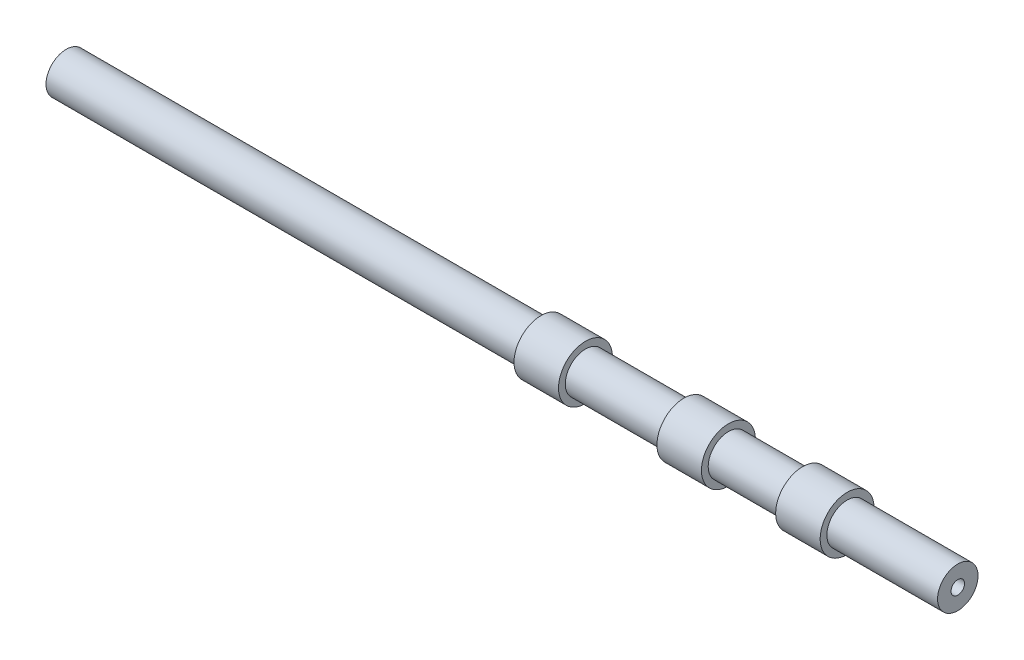
ISO-10303-21;
HEADER;
FILE_DESCRIPTION(('STEP AP214'),'2;1');
FILE_NAME('part.step','',(''),(''),'','','');
FILE_SCHEMA(('AUTOMOTIVE_DESIGN { 1 0 10303 214 1 1 1 1 }'));
ENDSEC;
DATA;
#1=APPLICATION_CONTEXT('core data for automotive mechanical design processes');
#2=APPLICATION_PROTOCOL_DEFINITION('international standard','automotive_design',2000,#1);
#3=PRODUCT_CONTEXT('',#1,'mechanical');
#4=PRODUCT('Part','Part','',(#3));
#5=PRODUCT_RELATED_PRODUCT_CATEGORY('part','',(#4));
#6=PRODUCT_DEFINITION_FORMATION('','',#4);
#7=PRODUCT_DEFINITION_CONTEXT('part definition',#1,'design');
#8=PRODUCT_DEFINITION('design','',#6,#7);
#9=PRODUCT_DEFINITION_SHAPE('','',#8);
#10=(LENGTH_UNIT() NAMED_UNIT(*) SI_UNIT(.MILLI.,.METRE.));
#11=(NAMED_UNIT(*) PLANE_ANGLE_UNIT() SI_UNIT($,.RADIAN.));
#12=(NAMED_UNIT(*) SI_UNIT($,.STERADIAN.) SOLID_ANGLE_UNIT());
#13=UNCERTAINTY_MEASURE_WITH_UNIT(LENGTH_MEASURE(1.E-05),#10,'distance_accuracy_value','');
#14=(GEOMETRIC_REPRESENTATION_CONTEXT(3) GLOBAL_UNCERTAINTY_ASSIGNED_CONTEXT((#13)) GLOBAL_UNIT_ASSIGNED_CONTEXT((#10,
#11,#12)) REPRESENTATION_CONTEXT('',''));
#15=CARTESIAN_POINT('',(0.,0.,0.));
#16=DIRECTION('',(0.,0.,1.));
#17=DIRECTION('',(1.,0.,0.));
#18=AXIS2_PLACEMENT_3D('',#15,#16,#17);
#19=CARTESIAN_POINT('',(-141.8294649099,0.,0.));
#20=DIRECTION('',(-1.,0.,0.));
#21=DIRECTION('',(0.,0.,1.));
#22=AXIS2_PLACEMENT_3D('',#19,#20,#21);
#23=CYLINDRICAL_SURFACE('',#22,15.);
#24=CARTESIAN_POINT('',(-374.696506637372,0.,0.));
#25=DIRECTION('',(-1.,0.,0.));
#26=DIRECTION('',(0.,0.,1.));
#27=AXIS2_PLACEMENT_3D('',#24,#25,#26);
#28=CIRCLE('',#27,15.);
#29=CARTESIAN_POINT('',(-374.696506637372,0.,15.));
#30=VERTEX_POINT('',#29);
#31=EDGE_CURVE('E119',#30,#30,#28,.T.);
#32=ORIENTED_EDGE('',*,*,#31,.F.);
#33=EDGE_LOOP('',(#32));
#34=FACE_BOUND('',#33,.T.);
#35=CARTESIAN_POINT('',(-22.8165066373719,0.,0.));
#36=DIRECTION('',(-1.,0.,0.));
#37=DIRECTION('',(0.,0.,1.));
#38=AXIS2_PLACEMENT_3D('',#35,#36,#37);
#39=CIRCLE('',#38,15.);
#40=CARTESIAN_POINT('',(-22.8165066373719,0.,15.));
#41=VERTEX_POINT('',#40);
#42=EDGE_CURVE('E10',#41,#41,#39,.T.);
#43=ORIENTED_EDGE('',*,*,#42,.T.);
#44=EDGE_LOOP('',(#43));
#45=FACE_BOUND('',#44,.T.);
#46=ADVANCED_FACE('F31',(#34,#45),#23,.T.);
#47=CARTESIAN_POINT('',(-22.8165066373719,20.,0.));
#48=DIRECTION('',(1.,0.,0.));
#49=DIRECTION('',(0.,0.,-1.));
#50=AXIS2_PLACEMENT_3D('',#47,#48,#49);
#51=PLANE('',#50);
#52=ORIENTED_EDGE('',*,*,#42,.F.);
#53=EDGE_LOOP('',(#52));
#54=FACE_BOUND('',#53,.T.);
#55=CARTESIAN_POINT('',(-22.8165066373719,0.,0.));
#56=DIRECTION('',(-1.,0.,0.));
#57=DIRECTION('',(0.,0.,1.));
#58=AXIS2_PLACEMENT_3D('',#55,#56,#57);
#59=CIRCLE('',#58,20.);
#60=CARTESIAN_POINT('',(-22.8165066373719,0.,20.));
#61=VERTEX_POINT('',#60);
#62=EDGE_CURVE('E37',#61,#61,#59,.T.);
#63=ORIENTED_EDGE('',*,*,#62,.T.);
#64=EDGE_LOOP('',(#63));
#65=FACE_BOUND('',#64,.T.);
#66=ADVANCED_FACE('F127',(#54,#65),#51,.F.);
#67=CARTESIAN_POINT('',(-141.8294649099,0.,0.));
#68=DIRECTION('',(-1.,0.,0.));
#69=DIRECTION('',(0.,0.,1.));
#70=AXIS2_PLACEMENT_3D('',#67,#68,#69);
#71=CYLINDRICAL_SURFACE('',#70,20.);
#72=ORIENTED_EDGE('',*,*,#62,.F.);
#73=EDGE_LOOP('',(#72));
#74=FACE_BOUND('',#73,.T.);
#75=CARTESIAN_POINT('',(10.1534933626281,0.,0.));
#76=DIRECTION('',(-1.,0.,0.));
#77=DIRECTION('',(0.,0.,1.));
#78=AXIS2_PLACEMENT_3D('',#75,#76,#77);
#79=CIRCLE('',#78,20.);
#80=CARTESIAN_POINT('',(10.1534933626281,0.,20.));
#81=VERTEX_POINT('',#80);
#82=EDGE_CURVE('E41',#81,#81,#79,.T.);
#83=ORIENTED_EDGE('',*,*,#82,.T.);
#84=EDGE_LOOP('',(#83));
#85=FACE_BOUND('',#84,.T.);
#86=ADVANCED_FACE('F131',(#74,#85),#71,.T.);
#87=CARTESIAN_POINT('',(10.1534933626281,15.,0.));
#88=DIRECTION('',(-1.,0.,0.));
#89=DIRECTION('',(0.,0.,1.));
#90=AXIS2_PLACEMENT_3D('',#87,#88,#89);
#91=PLANE('',#90);
#92=ORIENTED_EDGE('',*,*,#82,.F.);
#93=EDGE_LOOP('',(#92));
#94=FACE_BOUND('',#93,.T.);
#95=CARTESIAN_POINT('',(10.1534933626281,0.,0.));
#96=DIRECTION('',(-1.,0.,0.));
#97=DIRECTION('',(0.,0.,1.));
#98=AXIS2_PLACEMENT_3D('',#95,#96,#97);
#99=CIRCLE('',#98,15.);
#100=CARTESIAN_POINT('',(10.1534933626281,0.,15.));
#101=VERTEX_POINT('',#100);
#102=EDGE_CURVE('E45',#101,#101,#99,.T.);
#103=ORIENTED_EDGE('',*,*,#102,.T.);
#104=EDGE_LOOP('',(#103));
#105=FACE_BOUND('',#104,.T.);
#106=ADVANCED_FACE('F136',(#94,#105),#91,.F.);
#107=CARTESIAN_POINT('',(-141.8294649099,0.,0.));
#108=DIRECTION('',(-1.,0.,0.));
#109=DIRECTION('',(0.,0.,1.));
#110=AXIS2_PLACEMENT_3D('',#107,#108,#109);
#111=CYLINDRICAL_SURFACE('',#110,15.);
#112=ORIENTED_EDGE('',*,*,#102,.F.);
#113=EDGE_LOOP('',(#112));
#114=FACE_BOUND('',#113,.T.);
#115=CARTESIAN_POINT('',(83.1234933626281,0.,0.));
#116=DIRECTION('',(-1.,0.,0.));
#117=DIRECTION('',(0.,0.,1.));
#118=AXIS2_PLACEMENT_3D('',#115,#116,#117);
#119=CIRCLE('',#118,15.);
#120=CARTESIAN_POINT('',(83.1234933626281,0.,15.));
#121=VERTEX_POINT('',#120);
#122=EDGE_CURVE('E50',#121,#121,#119,.T.);
#123=ORIENTED_EDGE('',*,*,#122,.T.);
#124=EDGE_LOOP('',(#123));
#125=FACE_BOUND('',#124,.T.);
#126=ADVANCED_FACE('F142',(#114,#125),#111,.T.);
#127=CARTESIAN_POINT('',(83.1234933626281,20.,0.));
#128=DIRECTION('',(1.,0.,0.));
#129=DIRECTION('',(0.,0.,-1.));
#130=AXIS2_PLACEMENT_3D('',#127,#128,#129);
#131=PLANE('',#130);
#132=ORIENTED_EDGE('',*,*,#122,.F.);
#133=EDGE_LOOP('',(#132));
#134=FACE_BOUND('',#133,.T.);
#135=CARTESIAN_POINT('',(83.1234933626281,0.,0.));
#136=DIRECTION('',(-1.,0.,0.));
#137=DIRECTION('',(0.,0.,1.));
#138=AXIS2_PLACEMENT_3D('',#135,#136,#137);
#139=CIRCLE('',#138,20.);
#140=CARTESIAN_POINT('',(83.1234933626281,0.,20.));
#141=VERTEX_POINT('',#140);
#142=EDGE_CURVE('E53',#141,#141,#139,.T.);
#143=ORIENTED_EDGE('',*,*,#142,.T.);
#144=EDGE_LOOP('',(#143));
#145=FACE_BOUND('',#144,.T.);
#146=ADVANCED_FACE('F146',(#134,#145),#131,.F.);
#147=CARTESIAN_POINT('',(-141.8294649099,0.,0.));
#148=DIRECTION('',(-1.,0.,0.));
#149=DIRECTION('',(0.,0.,1.));
#150=AXIS2_PLACEMENT_3D('',#147,#148,#149);
#151=CYLINDRICAL_SURFACE('',#150,20.);
#152=ORIENTED_EDGE('',*,*,#142,.F.);
#153=EDGE_LOOP('',(#152));
#154=FACE_BOUND('',#153,.T.);
#155=CARTESIAN_POINT('',(116.093493362628,0.,0.));
#156=DIRECTION('',(-1.,0.,0.));
#157=DIRECTION('',(0.,0.,1.));
#158=AXIS2_PLACEMENT_3D('',#155,#156,#157);
#159=CIRCLE('',#158,20.);
#160=CARTESIAN_POINT('',(116.093493362628,0.,20.));
#161=VERTEX_POINT('',#160);
#162=EDGE_CURVE('E56',#161,#161,#159,.T.);
#163=ORIENTED_EDGE('',*,*,#162,.T.);
#164=EDGE_LOOP('',(#163));
#165=FACE_BOUND('',#164,.T.);
#166=ADVANCED_FACE('F150',(#154,#165),#151,.T.);
#167=CARTESIAN_POINT('',(116.093493362628,15.,0.));
#168=DIRECTION('',(-1.,0.,0.));
#169=DIRECTION('',(0.,0.,1.));
#170=AXIS2_PLACEMENT_3D('',#167,#168,#169);
#171=PLANE('',#170);
#172=ORIENTED_EDGE('',*,*,#162,.F.);
#173=EDGE_LOOP('',(#172));
#174=FACE_BOUND('',#173,.T.);
#175=CARTESIAN_POINT('',(116.093493362628,0.,0.));
#176=DIRECTION('',(-1.,0.,0.));
#177=DIRECTION('',(0.,0.,1.));
#178=AXIS2_PLACEMENT_3D('',#175,#176,#177);
#179=CIRCLE('',#178,15.);
#180=CARTESIAN_POINT('',(116.093493362628,0.,15.));
#181=VERTEX_POINT('',#180);
#182=EDGE_CURVE('E59',#181,#181,#179,.T.);
#183=ORIENTED_EDGE('',*,*,#182,.T.);
#184=EDGE_LOOP('',(#183));
#185=FACE_BOUND('',#184,.T.);
#186=ADVANCED_FACE('F154',(#174,#185),#171,.F.);
#187=CARTESIAN_POINT('',(-141.8294649099,0.,0.));
#188=DIRECTION('',(-1.,0.,0.));
#189=DIRECTION('',(0.,0.,1.));
#190=AXIS2_PLACEMENT_3D('',#187,#188,#189);
#191=CYLINDRICAL_SURFACE('',#190,15.);
#192=ORIENTED_EDGE('',*,*,#182,.F.);
#193=EDGE_LOOP('',(#192));
#194=FACE_BOUND('',#193,.T.);
#195=CARTESIAN_POINT('',(171.093493362628,0.,0.));
#196=DIRECTION('',(-1.,0.,0.));
#197=DIRECTION('',(0.,0.,1.));
#198=AXIS2_PLACEMENT_3D('',#195,#196,#197);
#199=CIRCLE('',#198,15.);
#200=CARTESIAN_POINT('',(171.093493362628,0.,15.));
#201=VERTEX_POINT('',#200);
#202=EDGE_CURVE('E62',#201,#201,#199,.T.);
#203=ORIENTED_EDGE('',*,*,#202,.T.);
#204=EDGE_LOOP('',(#203));
#205=FACE_BOUND('',#204,.T.);
#206=ADVANCED_FACE('F158',(#194,#205),#191,.T.);
#207=CARTESIAN_POINT('',(171.093493362628,20.,0.));
#208=DIRECTION('',(1.,0.,0.));
#209=DIRECTION('',(0.,0.,-1.));
#210=AXIS2_PLACEMENT_3D('',#207,#208,#209);
#211=PLANE('',#210);
#212=ORIENTED_EDGE('',*,*,#202,.F.);
#213=EDGE_LOOP('',(#212));
#214=FACE_BOUND('',#213,.T.);
#215=CARTESIAN_POINT('',(171.093493362628,0.,0.));
#216=DIRECTION('',(-1.,0.,0.));
#217=DIRECTION('',(0.,0.,1.));
#218=AXIS2_PLACEMENT_3D('',#215,#216,#217);
#219=CIRCLE('',#218,20.);
#220=CARTESIAN_POINT('',(171.093493362628,0.,20.));
#221=VERTEX_POINT('',#220);
#222=EDGE_CURVE('E65',#221,#221,#219,.T.);
#223=ORIENTED_EDGE('',*,*,#222,.T.);
#224=EDGE_LOOP('',(#223));
#225=FACE_BOUND('',#224,.T.);
#226=ADVANCED_FACE('F162',(#214,#225),#211,.F.);
#227=CARTESIAN_POINT('',(-141.8294649099,0.,0.));
#228=DIRECTION('',(-1.,0.,0.));
#229=DIRECTION('',(0.,0.,1.));
#230=AXIS2_PLACEMENT_3D('',#227,#228,#229);
#231=CYLINDRICAL_SURFACE('',#230,20.);
#232=ORIENTED_EDGE('',*,*,#222,.F.);
#233=EDGE_LOOP('',(#232));
#234=FACE_BOUND('',#233,.T.);
#235=CARTESIAN_POINT('',(204.063493362628,0.,0.));
#236=DIRECTION('',(-1.,0.,0.));
#237=DIRECTION('',(0.,0.,1.));
#238=AXIS2_PLACEMENT_3D('',#235,#236,#237);
#239=CIRCLE('',#238,20.);
#240=CARTESIAN_POINT('',(204.063493362628,0.,20.));
#241=VERTEX_POINT('',#240);
#242=EDGE_CURVE('E68',#241,#241,#239,.T.);
#243=ORIENTED_EDGE('',*,*,#242,.T.);
#244=EDGE_LOOP('',(#243));
#245=FACE_BOUND('',#244,.T.);
#246=ADVANCED_FACE('F166',(#234,#245),#231,.T.);
#247=CARTESIAN_POINT('',(204.063493362628,15.,0.));
#248=DIRECTION('',(-1.,0.,0.));
#249=DIRECTION('',(0.,0.,1.));
#250=AXIS2_PLACEMENT_3D('',#247,#248,#249);
#251=PLANE('',#250);
#252=ORIENTED_EDGE('',*,*,#242,.F.);
#253=EDGE_LOOP('',(#252));
#254=FACE_BOUND('',#253,.T.);
#255=CARTESIAN_POINT('',(204.063493362628,0.,0.));
#256=DIRECTION('',(-1.,0.,0.));
#257=DIRECTION('',(0.,0.,1.));
#258=AXIS2_PLACEMENT_3D('',#255,#256,#257);
#259=CIRCLE('',#258,15.);
#260=CARTESIAN_POINT('',(204.063493362628,0.,15.));
#261=VERTEX_POINT('',#260);
#262=EDGE_CURVE('E71',#261,#261,#259,.T.);
#263=ORIENTED_EDGE('',*,*,#262,.T.);
#264=EDGE_LOOP('',(#263));
#265=FACE_BOUND('',#264,.T.);
#266=ADVANCED_FACE('F170',(#254,#265),#251,.F.);
#267=CARTESIAN_POINT('',(-141.8294649099,0.,0.));
#268=DIRECTION('',(-1.,0.,0.));
#269=DIRECTION('',(0.,0.,1.));
#270=AXIS2_PLACEMENT_3D('',#267,#268,#269);
#271=CYLINDRICAL_SURFACE('',#270,15.);
#272=ORIENTED_EDGE('',*,*,#262,.F.);
#273=EDGE_LOOP('',(#272));
#274=FACE_BOUND('',#273,.T.);
#275=CARTESIAN_POINT('',(286.093493362628,0.,0.));
#276=DIRECTION('',(-1.,0.,0.));
#277=DIRECTION('',(0.,0.,1.));
#278=AXIS2_PLACEMENT_3D('',#275,#276,#277);
#279=CIRCLE('',#278,15.);
#280=CARTESIAN_POINT('',(286.093493362628,0.,15.));
#281=VERTEX_POINT('',#280);
#282=EDGE_CURVE('E74',#281,#281,#279,.T.);
#283=ORIENTED_EDGE('',*,*,#282,.T.);
#284=EDGE_LOOP('',(#283));
#285=FACE_BOUND('',#284,.T.);
#286=ADVANCED_FACE('F174',(#274,#285),#271,.T.);
#287=CARTESIAN_POINT('',(286.093493362628,15.,0.));
#288=DIRECTION('',(1.,0.,0.));
#289=DIRECTION('',(0.,0.,-1.));
#290=AXIS2_PLACEMENT_3D('',#287,#288,#289);
#291=PLANE('',#290);
#292=CARTESIAN_POINT('',(286.093493362628,0.,0.));
#293=DIRECTION('',(-1.,0.,0.));
#294=DIRECTION('',(0.,0.,1.));
#295=AXIS2_PLACEMENT_3D('',#292,#293,#294);
#296=CIRCLE('',#295,5.);
#297=CARTESIAN_POINT('',(286.093493362628,0.,5.));
#298=VERTEX_POINT('',#297);
#299=EDGE_CURVE('E77',#298,#298,#296,.T.);
#300=ORIENTED_EDGE('',*,*,#299,.T.);
#301=EDGE_LOOP('',(#300));
#302=FACE_BOUND('',#301,.T.);
#303=ORIENTED_EDGE('',*,*,#282,.F.);
#304=EDGE_LOOP('',(#303));
#305=FACE_BOUND('',#304,.T.);
#306=ADVANCED_FACE('F178',(#302,#305),#291,.T.);
#307=CARTESIAN_POINT('',(-141.8294649099,0.,0.));
#308=DIRECTION('',(-1.,0.,0.));
#309=DIRECTION('',(0.,0.,1.));
#310=AXIS2_PLACEMENT_3D('',#307,#308,#309);
#311=CYLINDRICAL_SURFACE('',#310,4.99999999999999);
#312=CARTESIAN_POINT('',(194.063493362628,0.,0.));
#313=DIRECTION('',(-1.,0.,0.));
#314=DIRECTION('',(0.,0.,1.));
#315=AXIS2_PLACEMENT_3D('',#312,#313,#314);
#316=CIRCLE('',#315,4.99999999999998);
#317=CARTESIAN_POINT('',(194.063493362628,0.,4.99999999999998));
#318=VERTEX_POINT('',#317);
#319=EDGE_CURVE('E80',#318,#318,#316,.T.);
#320=ORIENTED_EDGE('',*,*,#319,.T.);
#321=EDGE_LOOP('',(#320));
#322=FACE_BOUND('',#321,.T.);
#323=ORIENTED_EDGE('',*,*,#299,.F.);
#324=EDGE_LOOP('',(#323));
#325=FACE_BOUND('',#324,.T.);
#326=ADVANCED_FACE('F182',(#322,#325),#311,.F.);
#327=CARTESIAN_POINT('',(194.063493362628,15.,0.));
#328=DIRECTION('',(-1.,0.,0.));
#329=DIRECTION('',(0.,0.,1.));
#330=AXIS2_PLACEMENT_3D('',#327,#328,#329);
#331=PLANE('',#330);
#332=CARTESIAN_POINT('',(194.063493362628,0.,0.));
#333=DIRECTION('',(-1.,0.,0.));
#334=DIRECTION('',(0.,0.,1.));
#335=AXIS2_PLACEMENT_3D('',#332,#333,#334);
#336=CIRCLE('',#335,10.);
#337=CARTESIAN_POINT('',(194.063493362628,0.,10.));
#338=VERTEX_POINT('',#337);
#339=EDGE_CURVE('E83',#338,#338,#336,.T.);
#340=ORIENTED_EDGE('',*,*,#339,.T.);
#341=EDGE_LOOP('',(#340));
#342=FACE_BOUND('',#341,.T.);
#343=ORIENTED_EDGE('',*,*,#319,.F.);
#344=EDGE_LOOP('',(#343));
#345=FACE_BOUND('',#344,.T.);
#346=ADVANCED_FACE('F186',(#342,#345),#331,.T.);
#347=CARTESIAN_POINT('',(-141.8294649099,0.,0.));
#348=DIRECTION('',(-1.,0.,0.));
#349=DIRECTION('',(0.,0.,1.));
#350=AXIS2_PLACEMENT_3D('',#347,#348,#349);
#351=CYLINDRICAL_SURFACE('',#350,10.);
#352=CARTESIAN_POINT('',(181.093493362628,0.,0.));
#353=DIRECTION('',(-1.,0.,0.));
#354=DIRECTION('',(0.,0.,1.));
#355=AXIS2_PLACEMENT_3D('',#352,#353,#354);
#356=CIRCLE('',#355,10.);
#357=CARTESIAN_POINT('',(181.093493362628,0.,10.));
#358=VERTEX_POINT('',#357);
#359=EDGE_CURVE('E86',#358,#358,#356,.T.);
#360=ORIENTED_EDGE('',*,*,#359,.T.);
#361=EDGE_LOOP('',(#360));
#362=FACE_BOUND('',#361,.T.);
#363=ORIENTED_EDGE('',*,*,#339,.F.);
#364=EDGE_LOOP('',(#363));
#365=FACE_BOUND('',#364,.T.);
#366=ADVANCED_FACE('F190',(#362,#365),#351,.F.);
#367=CARTESIAN_POINT('',(181.093493362628,20.,0.));
#368=DIRECTION('',(1.,0.,0.));
#369=DIRECTION('',(0.,0.,-1.));
#370=AXIS2_PLACEMENT_3D('',#367,#368,#369);
#371=PLANE('',#370);
#372=CARTESIAN_POINT('',(181.093493362628,0.,0.));
#373=DIRECTION('',(-1.,0.,0.));
#374=DIRECTION('',(0.,0.,1.));
#375=AXIS2_PLACEMENT_3D('',#372,#373,#374);
#376=CIRCLE('',#375,5.);
#377=CARTESIAN_POINT('',(181.093493362628,0.,5.));
#378=VERTEX_POINT('',#377);
#379=EDGE_CURVE('E89',#378,#378,#376,.T.);
#380=ORIENTED_EDGE('',*,*,#379,.T.);
#381=EDGE_LOOP('',(#380));
#382=FACE_BOUND('',#381,.T.);
#383=ORIENTED_EDGE('',*,*,#359,.F.);
#384=EDGE_LOOP('',(#383));
#385=FACE_BOUND('',#384,.T.);
#386=ADVANCED_FACE('F194',(#382,#385),#371,.T.);
#387=CARTESIAN_POINT('',(-141.8294649099,0.,0.));
#388=DIRECTION('',(-1.,0.,0.));
#389=DIRECTION('',(0.,0.,1.));
#390=AXIS2_PLACEMENT_3D('',#387,#388,#389);
#391=CYLINDRICAL_SURFACE('',#390,5.);
#392=CARTESIAN_POINT('',(106.093493362628,0.,0.));
#393=DIRECTION('',(-1.,0.,0.));
#394=DIRECTION('',(0.,0.,1.));
#395=AXIS2_PLACEMENT_3D('',#392,#393,#394);
#396=CIRCLE('',#395,4.99999999999999);
#397=CARTESIAN_POINT('',(106.093493362628,0.,4.99999999999999));
#398=VERTEX_POINT('',#397);
#399=EDGE_CURVE('E92',#398,#398,#396,.T.);
#400=ORIENTED_EDGE('',*,*,#399,.T.);
#401=EDGE_LOOP('',(#400));
#402=FACE_BOUND('',#401,.T.);
#403=ORIENTED_EDGE('',*,*,#379,.F.);
#404=EDGE_LOOP('',(#403));
#405=FACE_BOUND('',#404,.T.);
#406=ADVANCED_FACE('F198',(#402,#405),#391,.F.);
#407=CARTESIAN_POINT('',(106.093493362628,15.,0.));
#408=DIRECTION('',(-1.,0.,0.));
#409=DIRECTION('',(0.,0.,1.));
#410=AXIS2_PLACEMENT_3D('',#407,#408,#409);
#411=PLANE('',#410);
#412=CARTESIAN_POINT('',(106.093493362628,0.,0.));
#413=DIRECTION('',(-1.,0.,0.));
#414=DIRECTION('',(0.,0.,1.));
#415=AXIS2_PLACEMENT_3D('',#412,#413,#414);
#416=CIRCLE('',#415,10.);
#417=CARTESIAN_POINT('',(106.093493362628,0.,10.));
#418=VERTEX_POINT('',#417);
#419=EDGE_CURVE('E95',#418,#418,#416,.T.);
#420=ORIENTED_EDGE('',*,*,#419,.T.);
#421=EDGE_LOOP('',(#420));
#422=FACE_BOUND('',#421,.T.);
#423=ORIENTED_EDGE('',*,*,#399,.F.);
#424=EDGE_LOOP('',(#423));
#425=FACE_BOUND('',#424,.T.);
#426=ADVANCED_FACE('F202',(#422,#425),#411,.T.);
#427=CARTESIAN_POINT('',(-141.8294649099,0.,0.));
#428=DIRECTION('',(-1.,0.,0.));
#429=DIRECTION('',(0.,0.,1.));
#430=AXIS2_PLACEMENT_3D('',#427,#428,#429);
#431=CYLINDRICAL_SURFACE('',#430,10.);
#432=CARTESIAN_POINT('',(93.1234933626281,0.,0.));
#433=DIRECTION('',(-1.,0.,0.));
#434=DIRECTION('',(0.,0.,1.));
#435=AXIS2_PLACEMENT_3D('',#432,#433,#434);
#436=CIRCLE('',#435,10.);
#437=CARTESIAN_POINT('',(93.1234933626281,0.,10.));
#438=VERTEX_POINT('',#437);
#439=EDGE_CURVE('E98',#438,#438,#436,.T.);
#440=ORIENTED_EDGE('',*,*,#439,.T.);
#441=EDGE_LOOP('',(#440));
#442=FACE_BOUND('',#441,.T.);
#443=ORIENTED_EDGE('',*,*,#419,.F.);
#444=EDGE_LOOP('',(#443));
#445=FACE_BOUND('',#444,.T.);
#446=ADVANCED_FACE('F206',(#442,#445),#431,.F.);
#447=CARTESIAN_POINT('',(93.1234933626281,20.,0.));
#448=DIRECTION('',(1.,0.,0.));
#449=DIRECTION('',(0.,0.,-1.));
#450=AXIS2_PLACEMENT_3D('',#447,#448,#449);
#451=PLANE('',#450);
#452=CARTESIAN_POINT('',(93.1234933626281,0.,0.));
#453=DIRECTION('',(-1.,0.,0.));
#454=DIRECTION('',(0.,0.,1.));
#455=AXIS2_PLACEMENT_3D('',#452,#453,#454);
#456=CIRCLE('',#455,5.);
#457=CARTESIAN_POINT('',(93.1234933626281,0.,5.));
#458=VERTEX_POINT('',#457);
#459=EDGE_CURVE('E101',#458,#458,#456,.T.);
#460=ORIENTED_EDGE('',*,*,#459,.T.);
#461=EDGE_LOOP('',(#460));
#462=FACE_BOUND('',#461,.T.);
#463=ORIENTED_EDGE('',*,*,#439,.F.);
#464=EDGE_LOOP('',(#463));
#465=FACE_BOUND('',#464,.T.);
#466=ADVANCED_FACE('F210',(#462,#465),#451,.T.);
#467=CARTESIAN_POINT('',(-141.8294649099,0.,0.));
#468=DIRECTION('',(-1.,0.,0.));
#469=DIRECTION('',(0.,0.,1.));
#470=AXIS2_PLACEMENT_3D('',#467,#468,#469);
#471=CYLINDRICAL_SURFACE('',#470,4.99999999999999);
#472=CARTESIAN_POINT('',(0.153493362628071,0.,0.));
#473=DIRECTION('',(-1.,0.,0.));
#474=DIRECTION('',(0.,0.,1.));
#475=AXIS2_PLACEMENT_3D('',#472,#473,#474);
#476=CIRCLE('',#475,4.99999999999999);
#477=CARTESIAN_POINT('',(0.153493362628071,0.,4.99999999999999));
#478=VERTEX_POINT('',#477);
#479=EDGE_CURVE('E104',#478,#478,#476,.T.);
#480=ORIENTED_EDGE('',*,*,#479,.T.);
#481=EDGE_LOOP('',(#480));
#482=FACE_BOUND('',#481,.T.);
#483=ORIENTED_EDGE('',*,*,#459,.F.);
#484=EDGE_LOOP('',(#483));
#485=FACE_BOUND('',#484,.T.);
#486=ADVANCED_FACE('F214',(#482,#485),#471,.F.);
#487=CARTESIAN_POINT('',(0.153493362628066,15.,0.));
#488=DIRECTION('',(-1.,0.,0.));
#489=DIRECTION('',(0.,0.,1.));
#490=AXIS2_PLACEMENT_3D('',#487,#488,#489);
#491=PLANE('',#490);
#492=CARTESIAN_POINT('',(0.153493362628071,0.,0.));
#493=DIRECTION('',(-1.,0.,0.));
#494=DIRECTION('',(0.,0.,1.));
#495=AXIS2_PLACEMENT_3D('',#492,#493,#494);
#496=CIRCLE('',#495,10.);
#497=CARTESIAN_POINT('',(0.153493362628071,0.,10.));
#498=VERTEX_POINT('',#497);
#499=EDGE_CURVE('E107',#498,#498,#496,.T.);
#500=ORIENTED_EDGE('',*,*,#499,.T.);
#501=EDGE_LOOP('',(#500));
#502=FACE_BOUND('',#501,.T.);
#503=ORIENTED_EDGE('',*,*,#479,.F.);
#504=EDGE_LOOP('',(#503));
#505=FACE_BOUND('',#504,.T.);
#506=ADVANCED_FACE('F218',(#502,#505),#491,.T.);
#507=CARTESIAN_POINT('',(-141.8294649099,0.,0.));
#508=DIRECTION('',(-1.,0.,0.));
#509=DIRECTION('',(0.,0.,1.));
#510=AXIS2_PLACEMENT_3D('',#507,#508,#509);
#511=CYLINDRICAL_SURFACE('',#510,10.);
#512=CARTESIAN_POINT('',(-12.8165066373719,0.,0.));
#513=DIRECTION('',(-1.,0.,0.));
#514=DIRECTION('',(0.,0.,1.));
#515=AXIS2_PLACEMENT_3D('',#512,#513,#514);
#516=CIRCLE('',#515,10.);
#517=CARTESIAN_POINT('',(-12.8165066373719,0.,10.));
#518=VERTEX_POINT('',#517);
#519=EDGE_CURVE('E110',#518,#518,#516,.T.);
#520=ORIENTED_EDGE('',*,*,#519,.T.);
#521=EDGE_LOOP('',(#520));
#522=FACE_BOUND('',#521,.T.);
#523=ORIENTED_EDGE('',*,*,#499,.F.);
#524=EDGE_LOOP('',(#523));
#525=FACE_BOUND('',#524,.T.);
#526=ADVANCED_FACE('F222',(#522,#525),#511,.F.);
#527=CARTESIAN_POINT('',(-12.8165066373719,20.,0.));
#528=DIRECTION('',(1.,0.,0.));
#529=DIRECTION('',(0.,0.,-1.));
#530=AXIS2_PLACEMENT_3D('',#527,#528,#529);
#531=PLANE('',#530);
#532=CARTESIAN_POINT('',(-12.8165066373719,0.,0.));
#533=DIRECTION('',(-1.,0.,0.));
#534=DIRECTION('',(0.,0.,1.));
#535=AXIS2_PLACEMENT_3D('',#532,#533,#534);
#536=CIRCLE('',#535,4.99999999999999);
#537=CARTESIAN_POINT('',(-12.8165066373719,0.,4.99999999999999));
#538=VERTEX_POINT('',#537);
#539=EDGE_CURVE('E113',#538,#538,#536,.T.);
#540=ORIENTED_EDGE('',*,*,#539,.T.);
#541=EDGE_LOOP('',(#540));
#542=FACE_BOUND('',#541,.T.);
#543=ORIENTED_EDGE('',*,*,#519,.F.);
#544=EDGE_LOOP('',(#543));
#545=FACE_BOUND('',#544,.T.);
#546=ADVANCED_FACE('F226',(#542,#545),#531,.T.);
#547=CARTESIAN_POINT('',(-141.8294649099,0.,0.));
#548=DIRECTION('',(-1.,0.,0.));
#549=DIRECTION('',(0.,0.,1.));
#550=AXIS2_PLACEMENT_3D('',#547,#548,#549);
#551=CYLINDRICAL_SURFACE('',#550,5.);
#552=CARTESIAN_POINT('',(-374.696506637372,0.,0.));
#553=DIRECTION('',(-1.,0.,0.));
#554=DIRECTION('',(0.,0.,1.));
#555=AXIS2_PLACEMENT_3D('',#552,#553,#554);
#556=CIRCLE('',#555,4.99999999999999);
#557=CARTESIAN_POINT('',(-374.696506637372,0.,4.99999999999999));
#558=VERTEX_POINT('',#557);
#559=EDGE_CURVE('E116',#558,#558,#556,.T.);
#560=ORIENTED_EDGE('',*,*,#559,.T.);
#561=EDGE_LOOP('',(#560));
#562=FACE_BOUND('',#561,.T.);
#563=ORIENTED_EDGE('',*,*,#539,.F.);
#564=EDGE_LOOP('',(#563));
#565=FACE_BOUND('',#564,.T.);
#566=ADVANCED_FACE('F230',(#562,#565),#551,.F.);
#567=CARTESIAN_POINT('',(-374.696506637372,4.99999999999999,0.));
#568=DIRECTION('',(-1.,0.,0.));
#569=DIRECTION('',(0.,0.,1.));
#570=AXIS2_PLACEMENT_3D('',#567,#568,#569);
#571=PLANE('',#570);
#572=ORIENTED_EDGE('',*,*,#31,.T.);
#573=EDGE_LOOP('',(#572));
#574=FACE_BOUND('',#573,.T.);
#575=ORIENTED_EDGE('',*,*,#559,.F.);
#576=EDGE_LOOP('',(#575));
#577=FACE_BOUND('',#576,.T.);
#578=ADVANCED_FACE('F123',(#574,#577),#571,.T.);
#579=CLOSED_SHELL('',(#46,#66,#86,#106,#126,#146,#166,#186,#206,#226,#246,#266,#286,#306,#326,
#346,#366,#386,#406,#426,#446,#466,#486,#506,#526,#546,#566,#578));
#580=MANIFOLD_SOLID_BREP('B2',#579);
#581=ADVANCED_BREP_SHAPE_REPRESENTATION('',(#18,#580),#14);
#582=SHAPE_DEFINITION_REPRESENTATION(#9,#581);
ENDSEC;
END-ISO-10303-21;
